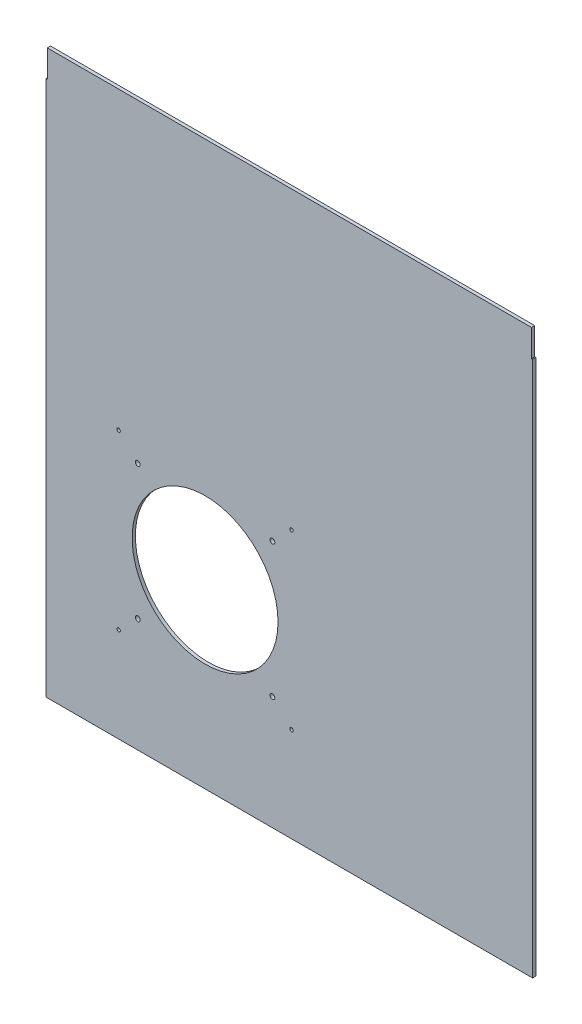
ISO-10303-21;
HEADER;
FILE_DESCRIPTION(('STEP AP214'),'2;1');
FILE_NAME('part.step','',(''),(''),'','','');
FILE_SCHEMA(('AUTOMOTIVE_DESIGN { 1 0 10303 214 1 1 1 1 }'));
ENDSEC;
DATA;
#1=APPLICATION_CONTEXT('core data for automotive mechanical design processes');
#2=APPLICATION_PROTOCOL_DEFINITION('international standard','automotive_design',2000,#1);
#3=PRODUCT_CONTEXT('',#1,'mechanical');
#4=PRODUCT('Part','Part','',(#3));
#5=PRODUCT_RELATED_PRODUCT_CATEGORY('part','',(#4));
#6=PRODUCT_DEFINITION_FORMATION('','',#4);
#7=PRODUCT_DEFINITION_CONTEXT('part definition',#1,'design');
#8=PRODUCT_DEFINITION('design','',#6,#7);
#9=PRODUCT_DEFINITION_SHAPE('','',#8);
#10=(LENGTH_UNIT() NAMED_UNIT(*) SI_UNIT(.MILLI.,.METRE.));
#11=(NAMED_UNIT(*) PLANE_ANGLE_UNIT() SI_UNIT($,.RADIAN.));
#12=(NAMED_UNIT(*) SI_UNIT($,.STERADIAN.) SOLID_ANGLE_UNIT());
#13=UNCERTAINTY_MEASURE_WITH_UNIT(LENGTH_MEASURE(1.E-05),#10,'distance_accuracy_value','');
#14=(GEOMETRIC_REPRESENTATION_CONTEXT(3) GLOBAL_UNCERTAINTY_ASSIGNED_CONTEXT((#13)) GLOBAL_UNIT_ASSIGNED_CONTEXT((#10,
#11,#12)) REPRESENTATION_CONTEXT('',''));
#15=CARTESIAN_POINT('',(0.,0.,0.));
#16=DIRECTION('',(0.,0.,1.));
#17=DIRECTION('',(1.,0.,0.));
#18=AXIS2_PLACEMENT_3D('',#15,#16,#17);
#19=CARTESIAN_POINT('',(187.161325966851,323.703267525864,3.));
#20=DIRECTION('',(-1.,0.,0.));
#21=DIRECTION('',(0.,0.,1.));
#22=AXIS2_PLACEMENT_3D('',#19,#20,#21);
#23=PLANE('',#22);
#24=DIRECTION('',(0.,1.,0.));
#25=VECTOR('',#24,1.);
#26=CARTESIAN_POINT('',(187.161325966851,323.703267525864,0.));
#27=LINE('',#26,#25);
#28=CARTESIAN_POINT('',(187.161325966851,298.703267525864,0.));
#29=VERTEX_POINT('',#28);
#30=CARTESIAN_POINT('',(187.161325966851,323.703267525864,0.));
#31=VERTEX_POINT('',#30);
#32=EDGE_CURVE('E130',#29,#31,#27,.T.);
#33=ORIENTED_EDGE('',*,*,#32,.T.);
#34=DIRECTION('',(0.,0.,-1.));
#35=VECTOR('',#34,1.);
#36=CARTESIAN_POINT('',(187.161325966851,323.703267525864,3.));
#37=LINE('',#36,#35);
#38=CARTESIAN_POINT('',(187.161325966851,323.703267525864,3.));
#39=VERTEX_POINT('',#38);
#40=EDGE_CURVE('E11',#39,#31,#37,.T.);
#41=ORIENTED_EDGE('',*,*,#40,.F.);
#42=DIRECTION('',(0.,1.,0.));
#43=VECTOR('',#42,1.);
#44=CARTESIAN_POINT('',(187.161325966851,323.703267525864,3.));
#45=LINE('',#44,#43);
#46=CARTESIAN_POINT('',(187.161325966851,298.703267525864,3.));
#47=VERTEX_POINT('',#46);
#48=EDGE_CURVE('E145',#47,#39,#45,.T.);
#49=ORIENTED_EDGE('',*,*,#48,.F.);
#50=DIRECTION('',(0.,0.,-1.));
#51=VECTOR('',#50,1.);
#52=CARTESIAN_POINT('',(187.161325966851,298.703267525864,3.));
#53=LINE('',#52,#51);
#54=EDGE_CURVE('E126',#47,#29,#53,.T.);
#55=ORIENTED_EDGE('',*,*,#54,.T.);
#56=EDGE_LOOP('',(#33,#41,#49,#55));
#57=FACE_BOUND('',#56,.T.);
#58=ADVANCED_FACE('F34',(#57),#23,.F.);
#59=CARTESIAN_POINT('',(-260.838674033149,323.703267525864,3.));
#60=DIRECTION('',(0.,-1.,0.));
#61=DIRECTION('',(0.,0.,-1.));
#62=AXIS2_PLACEMENT_3D('',#59,#60,#61);
#63=PLANE('',#62);
#64=DIRECTION('',(-1.,0.,0.));
#65=VECTOR('',#64,1.);
#66=CARTESIAN_POINT('',(-260.838674033149,323.703267525864,0.));
#67=LINE('',#66,#65);
#68=CARTESIAN_POINT('',(-260.838674033149,323.703267525864,0.));
#69=VERTEX_POINT('',#68);
#70=EDGE_CURVE('E133',#31,#69,#67,.T.);
#71=ORIENTED_EDGE('',*,*,#70,.T.);
#72=DIRECTION('',(0.,0.,-1.));
#73=VECTOR('',#72,1.);
#74=CARTESIAN_POINT('',(-260.838674033149,323.703267525864,3.));
#75=LINE('',#74,#73);
#76=CARTESIAN_POINT('',(-260.838674033149,323.703267525864,3.));
#77=VERTEX_POINT('',#76);
#78=EDGE_CURVE('E42',#77,#69,#75,.T.);
#79=ORIENTED_EDGE('',*,*,#78,.F.);
#80=DIRECTION('',(-1.,0.,0.));
#81=VECTOR('',#80,1.);
#82=CARTESIAN_POINT('',(-260.838674033149,323.703267525864,3.));
#83=LINE('',#82,#81);
#84=EDGE_CURVE('E93',#39,#77,#83,.T.);
#85=ORIENTED_EDGE('',*,*,#84,.F.);
#86=ORIENTED_EDGE('',*,*,#40,.T.);
#87=EDGE_LOOP('',(#71,#79,#85,#86));
#88=FACE_BOUND('',#87,.T.);
#89=ADVANCED_FACE('F261',(#88),#63,.F.);
#90=CARTESIAN_POINT('',(-260.838674033149,298.703267525864,3.));
#91=DIRECTION('',(1.,0.,0.));
#92=DIRECTION('',(0.,0.,-1.));
#93=AXIS2_PLACEMENT_3D('',#90,#91,#92);
#94=PLANE('',#93);
#95=DIRECTION('',(0.,-1.,0.));
#96=VECTOR('',#95,1.);
#97=CARTESIAN_POINT('',(-260.838674033149,298.703267525864,0.));
#98=LINE('',#97,#96);
#99=CARTESIAN_POINT('',(-260.838674033149,298.703267525864,0.));
#100=VERTEX_POINT('',#99);
#101=EDGE_CURVE('E136',#69,#100,#98,.T.);
#102=ORIENTED_EDGE('',*,*,#101,.T.);
#103=DIRECTION('',(0.,0.,-1.));
#104=VECTOR('',#103,1.);
#105=CARTESIAN_POINT('',(-260.838674033149,298.703267525864,3.));
#106=LINE('',#105,#104);
#107=CARTESIAN_POINT('',(-260.838674033149,298.703267525864,3.));
#108=VERTEX_POINT('',#107);
#109=EDGE_CURVE('E152',#108,#100,#106,.T.);
#110=ORIENTED_EDGE('',*,*,#109,.F.);
#111=DIRECTION('',(0.,-1.,0.));
#112=VECTOR('',#111,1.);
#113=CARTESIAN_POINT('',(-260.838674033149,298.703267525864,3.));
#114=LINE('',#113,#112);
#115=EDGE_CURVE('E160',#77,#108,#114,.T.);
#116=ORIENTED_EDGE('',*,*,#115,.F.);
#117=ORIENTED_EDGE('',*,*,#78,.T.);
#118=EDGE_LOOP('',(#102,#110,#116,#117));
#119=FACE_BOUND('',#118,.T.);
#120=ADVANCED_FACE('F158',(#119),#94,.F.);
#121=CARTESIAN_POINT('',(-261.838674033149,298.703267525864,3.));
#122=DIRECTION('',(0.,-1.,0.));
#123=DIRECTION('',(0.,0.,-1.));
#124=AXIS2_PLACEMENT_3D('',#121,#122,#123);
#125=PLANE('',#124);
#126=DIRECTION('',(-1.,0.,0.));
#127=VECTOR('',#126,1.);
#128=CARTESIAN_POINT('',(-261.838674033149,298.703267525864,0.));
#129=LINE('',#128,#127);
#130=CARTESIAN_POINT('',(-261.838674033149,298.703267525864,0.));
#131=VERTEX_POINT('',#130);
#132=EDGE_CURVE('E138',#100,#131,#129,.T.);
#133=ORIENTED_EDGE('',*,*,#132,.T.);
#134=DIRECTION('',(0.,0.,-1.));
#135=VECTOR('',#134,1.);
#136=CARTESIAN_POINT('',(-261.838674033149,298.703267525864,3.));
#137=LINE('',#136,#135);
#138=CARTESIAN_POINT('',(-261.838674033149,298.703267525864,3.));
#139=VERTEX_POINT('',#138);
#140=EDGE_CURVE('E149',#139,#131,#137,.T.);
#141=ORIENTED_EDGE('',*,*,#140,.F.);
#142=DIRECTION('',(-1.,0.,0.));
#143=VECTOR('',#142,1.);
#144=CARTESIAN_POINT('',(-261.838674033149,298.703267525864,3.));
#145=LINE('',#144,#143);
#146=EDGE_CURVE('E172',#108,#139,#145,.T.);
#147=ORIENTED_EDGE('',*,*,#146,.F.);
#148=ORIENTED_EDGE('',*,*,#109,.T.);
#149=EDGE_LOOP('',(#133,#141,#147,#148));
#150=FACE_BOUND('',#149,.T.);
#151=ADVANCED_FACE('F168',(#150),#125,.F.);
#152=CARTESIAN_POINT('',(-261.838674033149,298.703267525864,3.));
#153=DIRECTION('',(1.,0.,0.));
#154=DIRECTION('',(0.,1.,0.));
#155=AXIS2_PLACEMENT_3D('',#152,#153,#154);
#156=PLANE('',#155);
#157=DIRECTION('',(0.,-1.,0.));
#158=VECTOR('',#157,1.);
#159=CARTESIAN_POINT('',(-261.838674033149,298.703267525864,0.));
#160=LINE('',#159,#158);
#161=CARTESIAN_POINT('',(-261.838674033149,-197.096732474136,0.));
#162=VERTEX_POINT('',#161);
#163=EDGE_CURVE('E140',#131,#162,#160,.T.);
#164=ORIENTED_EDGE('',*,*,#163,.T.);
#165=DIRECTION('',(0.,0.,-1.));
#166=VECTOR('',#165,1.);
#167=CARTESIAN_POINT('',(-261.838674033149,-197.096732474136,3.));
#168=LINE('',#167,#166);
#169=CARTESIAN_POINT('',(-261.838674033149,-197.096732474136,3.));
#170=VERTEX_POINT('',#169);
#171=EDGE_CURVE('E121',#170,#162,#168,.T.);
#172=ORIENTED_EDGE('',*,*,#171,.F.);
#173=DIRECTION('',(0.,-1.,0.));
#174=VECTOR('',#173,1.);
#175=CARTESIAN_POINT('',(-261.838674033149,298.703267525864,3.));
#176=LINE('',#175,#174);
#177=EDGE_CURVE('E112',#139,#170,#176,.T.);
#178=ORIENTED_EDGE('',*,*,#177,.F.);
#179=ORIENTED_EDGE('',*,*,#140,.T.);
#180=EDGE_LOOP('',(#164,#172,#178,#179));
#181=FACE_BOUND('',#180,.T.);
#182=ADVANCED_FACE('F171',(#181),#156,.F.);
#183=CARTESIAN_POINT('',(-261.838674033149,-197.096732474136,3.));
#184=DIRECTION('',(0.,1.,0.));
#185=DIRECTION('',(0.,0.,1.));
#186=AXIS2_PLACEMENT_3D('',#183,#184,#185);
#187=PLANE('',#186);
#188=DIRECTION('',(1.,0.,0.));
#189=VECTOR('',#188,1.);
#190=CARTESIAN_POINT('',(-261.838674033149,-197.096732474136,0.));
#191=LINE('',#190,#189);
#192=CARTESIAN_POINT('',(188.161325966851,-197.096732474136,0.));
#193=VERTEX_POINT('',#192);
#194=EDGE_CURVE('E120',#162,#193,#191,.T.);
#195=ORIENTED_EDGE('',*,*,#194,.T.);
#196=DIRECTION('',(0.,0.,-1.));
#197=VECTOR('',#196,1.);
#198=CARTESIAN_POINT('',(188.161325966851,-197.096732474136,3.));
#199=LINE('',#198,#197);
#200=CARTESIAN_POINT('',(188.161325966851,-197.096732474136,3.));
#201=VERTEX_POINT('',#200);
#202=EDGE_CURVE('E117',#201,#193,#199,.T.);
#203=ORIENTED_EDGE('',*,*,#202,.F.);
#204=DIRECTION('',(1.,0.,0.));
#205=VECTOR('',#204,1.);
#206=CARTESIAN_POINT('',(-261.838674033149,-197.096732474136,3.));
#207=LINE('',#206,#205);
#208=EDGE_CURVE('E106',#170,#201,#207,.T.);
#209=ORIENTED_EDGE('',*,*,#208,.F.);
#210=ORIENTED_EDGE('',*,*,#171,.T.);
#211=EDGE_LOOP('',(#195,#203,#209,#210));
#212=FACE_BOUND('',#211,.T.);
#213=ADVANCED_FACE('F118',(#212),#187,.F.);
#214=CARTESIAN_POINT('',(188.161325966851,298.703267525864,3.));
#215=DIRECTION('',(-1.,0.,0.));
#216=DIRECTION('',(0.,-1.,0.));
#217=AXIS2_PLACEMENT_3D('',#214,#215,#216);
#218=PLANE('',#217);
#219=DIRECTION('',(0.,1.,0.));
#220=VECTOR('',#219,1.);
#221=CARTESIAN_POINT('',(188.161325966851,298.703267525864,0.));
#222=LINE('',#221,#220);
#223=CARTESIAN_POINT('',(188.161325966851,298.703267525864,0.));
#224=VERTEX_POINT('',#223);
#225=EDGE_CURVE('E79',#193,#224,#222,.T.);
#226=ORIENTED_EDGE('',*,*,#225,.T.);
#227=DIRECTION('',(0.,0.,-1.));
#228=VECTOR('',#227,1.);
#229=CARTESIAN_POINT('',(188.161325966851,298.703267525864,3.));
#230=LINE('',#229,#228);
#231=CARTESIAN_POINT('',(188.161325966851,298.703267525864,3.));
#232=VERTEX_POINT('',#231);
#233=EDGE_CURVE('E122',#232,#224,#230,.T.);
#234=ORIENTED_EDGE('',*,*,#233,.F.);
#235=DIRECTION('',(0.,1.,0.));
#236=VECTOR('',#235,1.);
#237=CARTESIAN_POINT('',(188.161325966851,298.703267525864,3.));
#238=LINE('',#237,#236);
#239=EDGE_CURVE('E110',#201,#232,#238,.T.);
#240=ORIENTED_EDGE('',*,*,#239,.F.);
#241=ORIENTED_EDGE('',*,*,#202,.T.);
#242=EDGE_LOOP('',(#226,#234,#240,#241));
#243=FACE_BOUND('',#242,.T.);
#244=ADVANCED_FACE('F124',(#243),#218,.F.);
#245=CARTESIAN_POINT('',(187.161325966851,298.703267525864,3.));
#246=DIRECTION('',(0.,-1.,0.));
#247=DIRECTION('',(0.,0.,-1.));
#248=AXIS2_PLACEMENT_3D('',#245,#246,#247);
#249=PLANE('',#248);
#250=DIRECTION('',(-1.,0.,0.));
#251=VECTOR('',#250,1.);
#252=CARTESIAN_POINT('',(187.161325966851,298.703267525864,0.));
#253=LINE('',#252,#251);
#254=EDGE_CURVE('E85',#224,#29,#253,.T.);
#255=ORIENTED_EDGE('',*,*,#254,.T.);
#256=ORIENTED_EDGE('',*,*,#54,.F.);
#257=DIRECTION('',(-1.,0.,0.));
#258=VECTOR('',#257,1.);
#259=CARTESIAN_POINT('',(187.161325966851,298.703267525864,3.));
#260=LINE('',#259,#258);
#261=EDGE_CURVE('E50',#232,#47,#260,.T.);
#262=ORIENTED_EDGE('',*,*,#261,.F.);
#263=ORIENTED_EDGE('',*,*,#233,.T.);
#264=EDGE_LOOP('',(#255,#256,#262,#263));
#265=FACE_BOUND('',#264,.T.);
#266=ADVANCED_FACE('F244',(#265),#249,.F.);
#267=CARTESIAN_POINT('',(0.,0.,3.));
#268=DIRECTION('',(0.,0.,1.));
#269=DIRECTION('',(1.,0.,0.));
#270=AXIS2_PLACEMENT_3D('',#267,#268,#269);
#271=PLANE('',#270);
#272=CARTESIAN_POINT('',(-194.838674033148,50.403267525863,3.));
#273=DIRECTION('',(0.,0.,1.));
#274=DIRECTION('',(1.,0.,0.));
#275=AXIS2_PLACEMENT_3D('',#272,#273,#274);
#276=CIRCLE('',#275,1.60000000000001);
#277=CARTESIAN_POINT('',(-193.238674033148,50.403267525863,3.));
#278=VERTEX_POINT('',#277);
#279=EDGE_CURVE('E184',#278,#278,#276,.T.);
#280=ORIENTED_EDGE('',*,*,#279,.F.);
#281=EDGE_LOOP('',(#280));
#282=FACE_BOUND('',#281,.T.);
#283=CARTESIAN_POINT('',(-177.088674033148,32.6532675258628,3.));
#284=DIRECTION('',(0.,0.,1.));
#285=DIRECTION('',(1.,0.,0.));
#286=AXIS2_PLACEMENT_3D('',#283,#284,#285);
#287=CIRCLE('',#286,2.24999999999999);
#288=CARTESIAN_POINT('',(-174.838674033148,32.6532675258628,3.));
#289=VERTEX_POINT('',#288);
#290=EDGE_CURVE('E190',#289,#289,#287,.T.);
#291=ORIENTED_EDGE('',*,*,#290,.F.);
#292=EDGE_LOOP('',(#291));
#293=FACE_BOUND('',#292,.T.);
#294=CARTESIAN_POINT('',(-194.838674033148,-109.596732474137,3.));
#295=DIRECTION('',(0.,0.,1.));
#296=DIRECTION('',(1.,0.,0.));
#297=AXIS2_PLACEMENT_3D('',#294,#295,#296);
#298=CIRCLE('',#297,1.59999999999999);
#299=CARTESIAN_POINT('',(-193.238674033148,-109.596732474137,3.));
#300=VERTEX_POINT('',#299);
#301=EDGE_CURVE('E196',#300,#300,#298,.T.);
#302=ORIENTED_EDGE('',*,*,#301,.F.);
#303=EDGE_LOOP('',(#302));
#304=FACE_BOUND('',#303,.T.);
#305=CARTESIAN_POINT('',(-177.088674033148,-91.8467324741375,3.));
#306=DIRECTION('',(0.,0.,1.));
#307=DIRECTION('',(1.,0.,0.));
#308=AXIS2_PLACEMENT_3D('',#305,#306,#307);
#309=CIRCLE('',#308,2.25);
#310=CARTESIAN_POINT('',(-174.838674033148,-91.8467324741375,3.));
#311=VERTEX_POINT('',#310);
#312=EDGE_CURVE('E202',#311,#311,#309,.T.);
#313=ORIENTED_EDGE('',*,*,#312,.F.);
#314=EDGE_LOOP('',(#313));
#315=FACE_BOUND('',#314,.T.);
#316=CARTESIAN_POINT('',(-34.838674033149,50.4032675258639,3.));
#317=DIRECTION('',(0.,0.,1.));
#318=DIRECTION('',(1.,0.,0.));
#319=AXIS2_PLACEMENT_3D('',#316,#317,#318);
#320=CIRCLE('',#319,1.60000000000001);
#321=CARTESIAN_POINT('',(-33.238674033149,50.4032675258639,3.));
#322=VERTEX_POINT('',#321);
#323=EDGE_CURVE('E208',#322,#322,#320,.T.);
#324=ORIENTED_EDGE('',*,*,#323,.F.);
#325=EDGE_LOOP('',(#324));
#326=FACE_BOUND('',#325,.T.);
#327=CARTESIAN_POINT('',(-34.8386740331476,-109.596732474136,3.));
#328=DIRECTION('',(0.,0.,1.));
#329=DIRECTION('',(1.,0.,0.));
#330=AXIS2_PLACEMENT_3D('',#327,#328,#329);
#331=CIRCLE('',#330,1.60000000000002);
#332=CARTESIAN_POINT('',(-33.2386740331475,-109.596732474136,3.));
#333=VERTEX_POINT('',#332);
#334=EDGE_CURVE('E214',#333,#333,#331,.T.);
#335=ORIENTED_EDGE('',*,*,#334,.F.);
#336=EDGE_LOOP('',(#335));
#337=FACE_BOUND('',#336,.T.);
#338=CARTESIAN_POINT('',(-52.5886740331475,-91.8467324741363,3.));
#339=DIRECTION('',(0.,0.,1.));
#340=DIRECTION('',(1.,0.,0.));
#341=AXIS2_PLACEMENT_3D('',#338,#339,#340);
#342=CIRCLE('',#341,2.25000000000001);
#343=CARTESIAN_POINT('',(-50.3386740331475,-91.8467324741363,3.));
#344=VERTEX_POINT('',#343);
#345=EDGE_CURVE('E220',#344,#344,#342,.T.);
#346=ORIENTED_EDGE('',*,*,#345,.F.);
#347=EDGE_LOOP('',(#346));
#348=FACE_BOUND('',#347,.T.);
#349=CARTESIAN_POINT('',(-52.588674033149,32.6532675258639,3.));
#350=DIRECTION('',(0.,0.,1.));
#351=DIRECTION('',(1.,0.,0.));
#352=AXIS2_PLACEMENT_3D('',#349,#350,#351);
#353=CIRCLE('',#352,2.25);
#354=CARTESIAN_POINT('',(-50.338674033149,32.6532675258639,3.));
#355=VERTEX_POINT('',#354);
#356=EDGE_CURVE('E226',#355,#355,#353,.T.);
#357=ORIENTED_EDGE('',*,*,#356,.F.);
#358=EDGE_LOOP('',(#357));
#359=FACE_BOUND('',#358,.T.);
#360=CARTESIAN_POINT('',(-114.838674033149,-29.5967324741361,3.));
#361=DIRECTION('',(0.,0.,1.));
#362=DIRECTION('',(1.,0.,0.));
#363=AXIS2_PLACEMENT_3D('',#360,#361,#362);
#364=CIRCLE('',#363,67.5);
#365=CARTESIAN_POINT('',(-47.338674033149,-29.5967324741361,3.));
#366=VERTEX_POINT('',#365);
#367=EDGE_CURVE('E178',#366,#366,#364,.T.);
#368=ORIENTED_EDGE('',*,*,#367,.F.);
#369=EDGE_LOOP('',(#368));
#370=FACE_BOUND('',#369,.T.);
#371=ORIENTED_EDGE('',*,*,#48,.T.);
#372=ORIENTED_EDGE('',*,*,#84,.T.);
#373=ORIENTED_EDGE('',*,*,#115,.T.);
#374=ORIENTED_EDGE('',*,*,#146,.T.);
#375=ORIENTED_EDGE('',*,*,#177,.T.);
#376=ORIENTED_EDGE('',*,*,#208,.T.);
#377=ORIENTED_EDGE('',*,*,#239,.T.);
#378=ORIENTED_EDGE('',*,*,#261,.T.);
#379=EDGE_LOOP('',(#371,#372,#373,#374,#375,#376,#377,#378));
#380=FACE_BOUND('',#379,.T.);
#381=ADVANCED_FACE('F108',(#282,#293,#304,#315,#326,#337,#348,#359,#370,#380),#271,.T.);
#382=CARTESIAN_POINT('',(0.,0.,0.));
#383=DIRECTION('',(0.,0.,1.));
#384=DIRECTION('',(1.,0.,0.));
#385=AXIS2_PLACEMENT_3D('',#382,#383,#384);
#386=PLANE('',#385);
#387=CARTESIAN_POINT('',(-194.838674033148,50.403267525863,0.));
#388=DIRECTION('',(0.,0.,1.));
#389=DIRECTION('',(1.,0.,0.));
#390=AXIS2_PLACEMENT_3D('',#387,#388,#389);
#391=CIRCLE('',#390,1.60000000000001);
#392=CARTESIAN_POINT('',(-193.238674033148,50.403267525863,0.));
#393=VERTEX_POINT('',#392);
#394=EDGE_CURVE('E187',#393,#393,#391,.T.);
#395=ORIENTED_EDGE('',*,*,#394,.T.);
#396=EDGE_LOOP('',(#395));
#397=FACE_BOUND('',#396,.T.);
#398=CARTESIAN_POINT('',(-177.088674033148,32.6532675258628,0.));
#399=DIRECTION('',(0.,0.,1.));
#400=DIRECTION('',(1.,0.,0.));
#401=AXIS2_PLACEMENT_3D('',#398,#399,#400);
#402=CIRCLE('',#401,2.24999999999999);
#403=CARTESIAN_POINT('',(-174.838674033148,32.6532675258628,0.));
#404=VERTEX_POINT('',#403);
#405=EDGE_CURVE('E193',#404,#404,#402,.T.);
#406=ORIENTED_EDGE('',*,*,#405,.T.);
#407=EDGE_LOOP('',(#406));
#408=FACE_BOUND('',#407,.T.);
#409=CARTESIAN_POINT('',(-194.838674033148,-109.596732474137,0.));
#410=DIRECTION('',(0.,0.,1.));
#411=DIRECTION('',(1.,0.,0.));
#412=AXIS2_PLACEMENT_3D('',#409,#410,#411);
#413=CIRCLE('',#412,1.59999999999999);
#414=CARTESIAN_POINT('',(-193.238674033148,-109.596732474137,0.));
#415=VERTEX_POINT('',#414);
#416=EDGE_CURVE('E199',#415,#415,#413,.T.);
#417=ORIENTED_EDGE('',*,*,#416,.T.);
#418=EDGE_LOOP('',(#417));
#419=FACE_BOUND('',#418,.T.);
#420=CARTESIAN_POINT('',(-177.088674033148,-91.8467324741375,0.));
#421=DIRECTION('',(0.,0.,1.));
#422=DIRECTION('',(1.,0.,0.));
#423=AXIS2_PLACEMENT_3D('',#420,#421,#422);
#424=CIRCLE('',#423,2.25);
#425=CARTESIAN_POINT('',(-174.838674033148,-91.8467324741375,0.));
#426=VERTEX_POINT('',#425);
#427=EDGE_CURVE('E205',#426,#426,#424,.T.);
#428=ORIENTED_EDGE('',*,*,#427,.T.);
#429=EDGE_LOOP('',(#428));
#430=FACE_BOUND('',#429,.T.);
#431=CARTESIAN_POINT('',(-34.838674033149,50.4032675258639,0.));
#432=DIRECTION('',(0.,0.,1.));
#433=DIRECTION('',(1.,0.,0.));
#434=AXIS2_PLACEMENT_3D('',#431,#432,#433);
#435=CIRCLE('',#434,1.60000000000001);
#436=CARTESIAN_POINT('',(-33.238674033149,50.4032675258639,0.));
#437=VERTEX_POINT('',#436);
#438=EDGE_CURVE('E211',#437,#437,#435,.T.);
#439=ORIENTED_EDGE('',*,*,#438,.T.);
#440=EDGE_LOOP('',(#439));
#441=FACE_BOUND('',#440,.T.);
#442=CARTESIAN_POINT('',(-34.8386740331476,-109.596732474136,0.));
#443=DIRECTION('',(0.,0.,1.));
#444=DIRECTION('',(1.,0.,0.));
#445=AXIS2_PLACEMENT_3D('',#442,#443,#444);
#446=CIRCLE('',#445,1.60000000000002);
#447=CARTESIAN_POINT('',(-33.2386740331475,-109.596732474136,0.));
#448=VERTEX_POINT('',#447);
#449=EDGE_CURVE('E217',#448,#448,#446,.T.);
#450=ORIENTED_EDGE('',*,*,#449,.T.);
#451=EDGE_LOOP('',(#450));
#452=FACE_BOUND('',#451,.T.);
#453=CARTESIAN_POINT('',(-52.5886740331475,-91.8467324741363,0.));
#454=DIRECTION('',(0.,0.,1.));
#455=DIRECTION('',(1.,0.,0.));
#456=AXIS2_PLACEMENT_3D('',#453,#454,#455);
#457=CIRCLE('',#456,2.25000000000001);
#458=CARTESIAN_POINT('',(-50.3386740331475,-91.8467324741363,0.));
#459=VERTEX_POINT('',#458);
#460=EDGE_CURVE('E223',#459,#459,#457,.T.);
#461=ORIENTED_EDGE('',*,*,#460,.T.);
#462=EDGE_LOOP('',(#461));
#463=FACE_BOUND('',#462,.T.);
#464=CARTESIAN_POINT('',(-52.588674033149,32.6532675258639,0.));
#465=DIRECTION('',(0.,0.,1.));
#466=DIRECTION('',(1.,0.,0.));
#467=AXIS2_PLACEMENT_3D('',#464,#465,#466);
#468=CIRCLE('',#467,2.25);
#469=CARTESIAN_POINT('',(-50.338674033149,32.6532675258639,0.));
#470=VERTEX_POINT('',#469);
#471=EDGE_CURVE('E181',#470,#470,#468,.T.);
#472=ORIENTED_EDGE('',*,*,#471,.T.);
#473=EDGE_LOOP('',(#472));
#474=FACE_BOUND('',#473,.T.);
#475=CARTESIAN_POINT('',(-114.838674033149,-29.5967324741361,0.));
#476=DIRECTION('',(0.,0.,1.));
#477=DIRECTION('',(1.,0.,0.));
#478=AXIS2_PLACEMENT_3D('',#475,#476,#477);
#479=CIRCLE('',#478,67.5);
#480=CARTESIAN_POINT('',(-47.338674033149,-29.5967324741361,0.));
#481=VERTEX_POINT('',#480);
#482=EDGE_CURVE('E134',#481,#481,#479,.T.);
#483=ORIENTED_EDGE('',*,*,#482,.T.);
#484=EDGE_LOOP('',(#483));
#485=FACE_BOUND('',#484,.T.);
#486=ORIENTED_EDGE('',*,*,#32,.F.);
#487=ORIENTED_EDGE('',*,*,#254,.F.);
#488=ORIENTED_EDGE('',*,*,#225,.F.);
#489=ORIENTED_EDGE('',*,*,#194,.F.);
#490=ORIENTED_EDGE('',*,*,#163,.F.);
#491=ORIENTED_EDGE('',*,*,#132,.F.);
#492=ORIENTED_EDGE('',*,*,#101,.F.);
#493=ORIENTED_EDGE('',*,*,#70,.F.);
#494=EDGE_LOOP('',(#486,#487,#488,#489,#490,#491,#492,#493));
#495=FACE_BOUND('',#494,.T.);
#496=ADVANCED_FACE('F164',(#397,#408,#419,#430,#441,#452,#463,#474,#485,#495),#386,.F.);
#497=CARTESIAN_POINT('',(-114.838674033149,-29.5967324741361,0.));
#498=DIRECTION('',(0.,0.,1.));
#499=DIRECTION('',(1.,0.,0.));
#500=AXIS2_PLACEMENT_3D('',#497,#498,#499);
#501=CYLINDRICAL_SURFACE('',#500,67.5);
#502=ORIENTED_EDGE('',*,*,#482,.F.);
#503=EDGE_LOOP('',(#502));
#504=FACE_BOUND('',#503,.T.);
#505=ORIENTED_EDGE('',*,*,#367,.T.);
#506=EDGE_LOOP('',(#505));
#507=FACE_BOUND('',#506,.T.);
#508=ADVANCED_FACE('F238',(#504,#507),#501,.F.);
#509=CARTESIAN_POINT('',(-52.588674033149,32.6532675258639,0.));
#510=DIRECTION('',(0.,0.,1.));
#511=DIRECTION('',(1.,0.,0.));
#512=AXIS2_PLACEMENT_3D('',#509,#510,#511);
#513=CYLINDRICAL_SURFACE('',#512,2.25);
#514=ORIENTED_EDGE('',*,*,#471,.F.);
#515=EDGE_LOOP('',(#514));
#516=FACE_BOUND('',#515,.T.);
#517=ORIENTED_EDGE('',*,*,#356,.T.);
#518=EDGE_LOOP('',(#517));
#519=FACE_BOUND('',#518,.T.);
#520=ADVANCED_FACE('F234',(#516,#519),#513,.F.);
#521=CARTESIAN_POINT('',(-52.5886740331475,-91.8467324741363,0.));
#522=DIRECTION('',(0.,0.,1.));
#523=DIRECTION('',(1.,0.,0.));
#524=AXIS2_PLACEMENT_3D('',#521,#522,#523);
#525=CYLINDRICAL_SURFACE('',#524,2.25000000000001);
#526=ORIENTED_EDGE('',*,*,#460,.F.);
#527=EDGE_LOOP('',(#526));
#528=FACE_BOUND('',#527,.T.);
#529=ORIENTED_EDGE('',*,*,#345,.T.);
#530=EDGE_LOOP('',(#529));
#531=FACE_BOUND('',#530,.T.);
#532=ADVANCED_FACE('F237',(#528,#531),#525,.F.);
#533=CARTESIAN_POINT('',(-34.8386740331476,-109.596732474136,0.));
#534=DIRECTION('',(0.,0.,1.));
#535=DIRECTION('',(1.,0.,0.));
#536=AXIS2_PLACEMENT_3D('',#533,#534,#535);
#537=CYLINDRICAL_SURFACE('',#536,1.60000000000002);
#538=ORIENTED_EDGE('',*,*,#449,.F.);
#539=EDGE_LOOP('',(#538));
#540=FACE_BOUND('',#539,.T.);
#541=ORIENTED_EDGE('',*,*,#334,.T.);
#542=EDGE_LOOP('',(#541));
#543=FACE_BOUND('',#542,.T.);
#544=ADVANCED_FACE('F332',(#540,#543),#537,.F.);
#545=CARTESIAN_POINT('',(-34.838674033149,50.4032675258639,0.));
#546=DIRECTION('',(0.,0.,1.));
#547=DIRECTION('',(1.,0.,0.));
#548=AXIS2_PLACEMENT_3D('',#545,#546,#547);
#549=CYLINDRICAL_SURFACE('',#548,1.60000000000001);
#550=ORIENTED_EDGE('',*,*,#438,.F.);
#551=EDGE_LOOP('',(#550));
#552=FACE_BOUND('',#551,.T.);
#553=ORIENTED_EDGE('',*,*,#323,.T.);
#554=EDGE_LOOP('',(#553));
#555=FACE_BOUND('',#554,.T.);
#556=ADVANCED_FACE('F342',(#552,#555),#549,.F.);
#557=CARTESIAN_POINT('',(-177.088674033148,-91.8467324741375,0.));
#558=DIRECTION('',(0.,0.,1.));
#559=DIRECTION('',(1.,0.,0.));
#560=AXIS2_PLACEMENT_3D('',#557,#558,#559);
#561=CYLINDRICAL_SURFACE('',#560,2.25);
#562=ORIENTED_EDGE('',*,*,#427,.F.);
#563=EDGE_LOOP('',(#562));
#564=FACE_BOUND('',#563,.T.);
#565=ORIENTED_EDGE('',*,*,#312,.T.);
#566=EDGE_LOOP('',(#565));
#567=FACE_BOUND('',#566,.T.);
#568=ADVANCED_FACE('F352',(#564,#567),#561,.F.);
#569=CARTESIAN_POINT('',(-194.838674033148,-109.596732474137,0.));
#570=DIRECTION('',(0.,0.,1.));
#571=DIRECTION('',(1.,0.,0.));
#572=AXIS2_PLACEMENT_3D('',#569,#570,#571);
#573=CYLINDRICAL_SURFACE('',#572,1.59999999999999);
#574=ORIENTED_EDGE('',*,*,#416,.F.);
#575=EDGE_LOOP('',(#574));
#576=FACE_BOUND('',#575,.T.);
#577=ORIENTED_EDGE('',*,*,#301,.T.);
#578=EDGE_LOOP('',(#577));
#579=FACE_BOUND('',#578,.T.);
#580=ADVANCED_FACE('F362',(#576,#579),#573,.F.);
#581=CARTESIAN_POINT('',(-177.088674033148,32.6532675258628,0.));
#582=DIRECTION('',(0.,0.,1.));
#583=DIRECTION('',(1.,0.,0.));
#584=AXIS2_PLACEMENT_3D('',#581,#582,#583);
#585=CYLINDRICAL_SURFACE('',#584,2.24999999999999);
#586=ORIENTED_EDGE('',*,*,#405,.F.);
#587=EDGE_LOOP('',(#586));
#588=FACE_BOUND('',#587,.T.);
#589=ORIENTED_EDGE('',*,*,#290,.T.);
#590=EDGE_LOOP('',(#589));
#591=FACE_BOUND('',#590,.T.);
#592=ADVANCED_FACE('F372',(#588,#591),#585,.F.);
#593=CARTESIAN_POINT('',(-194.838674033148,50.403267525863,0.));
#594=DIRECTION('',(0.,0.,1.));
#595=DIRECTION('',(1.,0.,0.));
#596=AXIS2_PLACEMENT_3D('',#593,#594,#595);
#597=CYLINDRICAL_SURFACE('',#596,1.60000000000001);
#598=ORIENTED_EDGE('',*,*,#394,.F.);
#599=EDGE_LOOP('',(#598));
#600=FACE_BOUND('',#599,.T.);
#601=ORIENTED_EDGE('',*,*,#279,.T.);
#602=EDGE_LOOP('',(#601));
#603=FACE_BOUND('',#602,.T.);
#604=ADVANCED_FACE('F382',(#600,#603),#597,.F.);
#605=CLOSED_SHELL('',(#58,#89,#120,#151,#182,#213,#244,#266,#381,#496,#508,#520,#532,#544,#556,
#568,#580,#592,#604));
#606=MANIFOLD_SOLID_BREP('B2',#605);
#607=ADVANCED_BREP_SHAPE_REPRESENTATION('',(#18,#606),#14);
#608=SHAPE_DEFINITION_REPRESENTATION(#9,#607);
ENDSEC;
END-ISO-10303-21;
